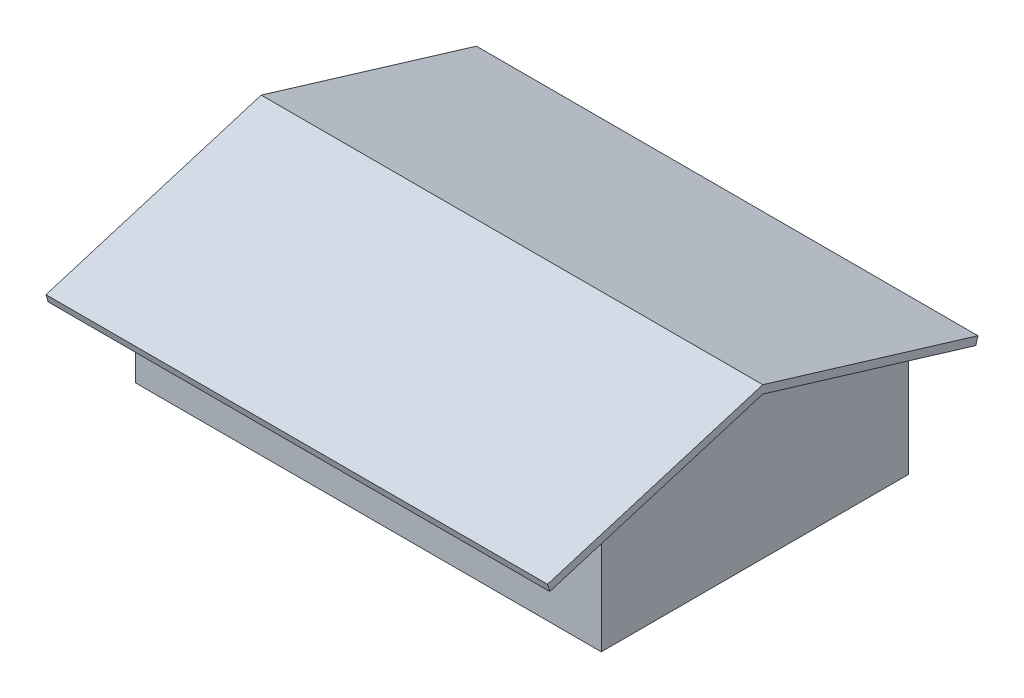
ISO-10303-21;
HEADER;
FILE_DESCRIPTION(('STEP AP214'),'2;1');
FILE_NAME('part.step','',(''),(''),'','','');
FILE_SCHEMA(('AUTOMOTIVE_DESIGN { 1 0 10303 214 1 1 1 1 }'));
ENDSEC;
DATA;
#1=APPLICATION_CONTEXT('core data for automotive mechanical design processes');
#2=APPLICATION_PROTOCOL_DEFINITION('international standard','automotive_design',2000,#1);
#3=PRODUCT_CONTEXT('',#1,'mechanical');
#4=PRODUCT('Part','Part','',(#3));
#5=PRODUCT_RELATED_PRODUCT_CATEGORY('part','',(#4));
#6=PRODUCT_DEFINITION_FORMATION('','',#4);
#7=PRODUCT_DEFINITION_CONTEXT('part definition',#1,'design');
#8=PRODUCT_DEFINITION('design','',#6,#7);
#9=PRODUCT_DEFINITION_SHAPE('','',#8);
#10=(LENGTH_UNIT() NAMED_UNIT(*) SI_UNIT(.MILLI.,.METRE.));
#11=(NAMED_UNIT(*) PLANE_ANGLE_UNIT() SI_UNIT($,.RADIAN.));
#12=(NAMED_UNIT(*) SI_UNIT($,.STERADIAN.) SOLID_ANGLE_UNIT());
#13=UNCERTAINTY_MEASURE_WITH_UNIT(LENGTH_MEASURE(1.E-05),#10,'distance_accuracy_value','');
#14=(GEOMETRIC_REPRESENTATION_CONTEXT(3) GLOBAL_UNCERTAINTY_ASSIGNED_CONTEXT((#13)) GLOBAL_UNIT_ASSIGNED_CONTEXT((#10,
#11,#12)) REPRESENTATION_CONTEXT('',''));
#15=CARTESIAN_POINT('',(0.,0.,0.));
#16=DIRECTION('',(0.,0.,1.));
#17=DIRECTION('',(1.,0.,0.));
#18=AXIS2_PLACEMENT_3D('',#15,#16,#17);
#19=CARTESIAN_POINT('',(7620.,0.,0.));
#20=DIRECTION('',(-1.,0.,0.));
#21=DIRECTION('',(0.,0.,1.));
#22=AXIS2_PLACEMENT_3D('',#19,#20,#21);
#23=PLANE('',#22);
#24=DIRECTION('',(0.,-0.290007395282871,-0.957024404433473));
#25=VECTOR('',#24,1.);
#26=CARTESIAN_POINT('',(7620.,4502.72101573984,-1364.46091386056));
#27=LINE('',#26,#25);
#28=CARTESIAN_POINT('',(7620.,4916.19401994001,3.10862446895044E-12));
#29=VERTEX_POINT('',#28);
#30=CARTESIAN_POINT('',(7620.,3392.19401994001,-5029.2));
#31=VERTEX_POINT('',#30);
#32=EDGE_CURVE('E148',#29,#31,#27,.T.);
#33=ORIENTED_EDGE('',*,*,#32,.F.);
#34=DIRECTION('',(0.,0.290007395282871,-0.957024404433473));
#35=VECTOR('',#34,1.);
#36=CARTESIAN_POINT('',(7620.,4502.72101573984,1364.46091386056));
#37=LINE('',#36,#35);
#38=CARTESIAN_POINT('',(7620.,3392.19401994001,5029.2));
#39=VERTEX_POINT('',#38);
#40=EDGE_CURVE('E45',#39,#29,#37,.T.);
#41=ORIENTED_EDGE('',*,*,#40,.F.);
#42=DIRECTION('',(0.,-1.,0.));
#43=VECTOR('',#42,1.);
#44=CARTESIAN_POINT('',(7620.,3392.19401994001,5029.2));
#45=LINE('',#44,#43);
#46=CARTESIAN_POINT('',(7620.,0.,5029.2));
#47=VERTEX_POINT('',#46);
#48=EDGE_CURVE('E190',#39,#47,#45,.T.);
#49=ORIENTED_EDGE('',*,*,#48,.T.);
#50=DIRECTION('',(0.,0.,-1.));
#51=VECTOR('',#50,1.);
#52=CARTESIAN_POINT('',(7620.,0.,5029.2));
#53=LINE('',#52,#51);
#54=CARTESIAN_POINT('',(7620.,0.,-5029.2));
#55=VERTEX_POINT('',#54);
#56=EDGE_CURVE('E54',#47,#55,#53,.T.);
#57=ORIENTED_EDGE('',*,*,#56,.T.);
#58=DIRECTION('',(0.,1.,0.));
#59=VECTOR('',#58,1.);
#60=CARTESIAN_POINT('',(7620.,0.,-5029.2));
#61=LINE('',#60,#59);
#62=EDGE_CURVE('E80',#55,#31,#61,.T.);
#63=ORIENTED_EDGE('',*,*,#62,.T.);
#64=EDGE_LOOP('',(#33,#41,#49,#57,#63));
#65=FACE_BOUND('',#64,.T.);
#66=ADVANCED_FACE('F35',(#65),#23,.F.);
#67=CARTESIAN_POINT('',(7620.,0.,-5029.2));
#68=DIRECTION('',(0.,0.,1.));
#69=DIRECTION('',(0.,-1.,0.));
#70=AXIS2_PLACEMENT_3D('',#67,#68,#69);
#71=PLANE('',#70);
#72=DIRECTION('',(0.,1.,0.));
#73=VECTOR('',#72,1.);
#74=CARTESIAN_POINT('',(-7620.,0.,-5029.2));
#75=LINE('',#74,#73);
#76=CARTESIAN_POINT('',(-7620.,0.,-5029.2));
#77=VERTEX_POINT('',#76);
#78=CARTESIAN_POINT('',(-7620.,3392.19401994001,-5029.2));
#79=VERTEX_POINT('',#78);
#80=EDGE_CURVE('E188',#77,#79,#75,.T.);
#81=ORIENTED_EDGE('',*,*,#80,.T.);
#82=DIRECTION('',(-1.,0.,0.));
#83=VECTOR('',#82,1.);
#84=CARTESIAN_POINT('',(7620.,3392.19401994001,-5029.2));
#85=LINE('',#84,#83);
#86=EDGE_CURVE('E39',#31,#79,#85,.T.);
#87=ORIENTED_EDGE('',*,*,#86,.F.);
#88=ORIENTED_EDGE('',*,*,#62,.F.);
#89=DIRECTION('',(-1.,0.,0.));
#90=VECTOR('',#89,1.);
#91=CARTESIAN_POINT('',(7620.,0.,-5029.2));
#92=LINE('',#91,#90);
#93=EDGE_CURVE('E193',#55,#77,#92,.T.);
#94=ORIENTED_EDGE('',*,*,#93,.T.);
#95=EDGE_LOOP('',(#81,#87,#88,#94));
#96=FACE_BOUND('',#95,.T.);
#97=ADVANCED_FACE('F37',(#96),#71,.F.);
#98=CARTESIAN_POINT('',(7620.,3392.19401994001,-5029.2));
#99=DIRECTION('',(0.,0.957024404433474,-0.290007395282871));
#100=DIRECTION('',(0.,0.290007395282871,0.957024404433474));
#101=AXIS2_PLACEMENT_3D('',#98,#99,#100);
#102=PLANE('',#101);
#103=ORIENTED_EDGE('',*,*,#86,.T.);
#104=DIRECTION('',(0.,0.290007395282871,0.957024404433474));
#105=VECTOR('',#104,1.);
#106=CARTESIAN_POINT('',(-7620.,4502.72101573984,-1364.46091386056));
#107=LINE('',#106,#105);
#108=CARTESIAN_POINT('',(-7620.,4916.19401994001,3.33066907387547E-12));
#109=VERTEX_POINT('',#108);
#110=EDGE_CURVE('E11',#79,#109,#107,.T.);
#111=ORIENTED_EDGE('',*,*,#110,.T.);
#112=DIRECTION('',(1.,0.,0.));
#113=VECTOR('',#112,1.);
#114=CARTESIAN_POINT('',(-8534.4,4916.19401994001,3.33066907387547E-12));
#115=LINE('',#114,#113);
#116=CARTESIAN_POINT('',(-8534.4,4916.19401994001,3.33066907387547E-12));
#117=VERTEX_POINT('',#116);
#118=EDGE_CURVE('E143',#117,#109,#115,.T.);
#119=ORIENTED_EDGE('',*,*,#118,.F.);
#120=DIRECTION('',(0.,0.290007395282871,0.957024404433473));
#121=VECTOR('',#120,1.);
#122=CARTESIAN_POINT('',(-8534.4,4502.72101573984,-1364.46091386056));
#123=LINE('',#122,#121);
#124=CARTESIAN_POINT('',(-8534.4,2804.9158012739,-6967.21812159815));
#125=VERTEX_POINT('',#124);
#126=EDGE_CURVE('E129',#125,#117,#123,.T.);
#127=ORIENTED_EDGE('',*,*,#126,.F.);
#128=DIRECTION('',(-1.,0.,0.));
#129=VECTOR('',#128,1.);
#130=CARTESIAN_POINT('',(7620.,2804.9158012739,-6967.21812159815));
#131=LINE('',#130,#129);
#132=CARTESIAN_POINT('',(7874.,2804.9158012739,-6967.21812159815));
#133=VERTEX_POINT('',#132);
#134=EDGE_CURVE('E209',#133,#125,#131,.T.);
#135=ORIENTED_EDGE('',*,*,#134,.F.);
#136=DIRECTION('',(0.,-0.290007395282871,-0.957024404433474));
#137=VECTOR('',#136,1.);
#138=CARTESIAN_POINT('',(7874.,4502.72101573984,-1364.46091386056));
#139=LINE('',#138,#137);
#140=CARTESIAN_POINT('',(7874.,4916.19401994001,3.10862446895044E-12));
#141=VERTEX_POINT('',#140);
#142=EDGE_CURVE('E175',#141,#133,#139,.T.);
#143=ORIENTED_EDGE('',*,*,#142,.F.);
#144=DIRECTION('',(-1.,0.,0.));
#145=VECTOR('',#144,1.);
#146=CARTESIAN_POINT('',(7874.,4916.19401994001,3.10862446895044E-12));
#147=LINE('',#146,#145);
#148=EDGE_CURVE('E181',#141,#29,#147,.T.);
#149=ORIENTED_EDGE('',*,*,#148,.T.);
#150=ORIENTED_EDGE('',*,*,#32,.T.);
#151=EDGE_LOOP('',(#103,#111,#119,#127,#135,#143,#149,#150));
#152=FACE_BOUND('',#151,.T.);
#153=ADVANCED_FACE('F145',(#152),#102,.F.);
#154=CARTESIAN_POINT('',(7620.,3048.,-7040.88));
#155=DIRECTION('',(0.,0.290007395282872,0.957024404433473));
#156=DIRECTION('',(0.,-0.957024404433473,0.290007395282872));
#157=AXIS2_PLACEMENT_3D('',#154,#155,#156);
#158=PLANE('',#157);
#159=ORIENTED_EDGE('',*,*,#134,.T.);
#160=DIRECTION('',(0.,-0.957024404433473,0.290007395282872));
#161=VECTOR('',#160,1.);
#162=CARTESIAN_POINT('',(-8534.4,-1697.80521446594,-5602.75720773759));
#163=LINE('',#162,#161);
#164=CARTESIAN_POINT('',(-8534.4,3048.,-7040.88));
#165=VERTEX_POINT('',#164);
#166=EDGE_CURVE('E138',#165,#125,#163,.T.);
#167=ORIENTED_EDGE('',*,*,#166,.F.);
#168=DIRECTION('',(-1.,0.,0.));
#169=VECTOR('',#168,1.);
#170=CARTESIAN_POINT('',(7620.,3048.,-7040.88));
#171=LINE('',#170,#169);
#172=CARTESIAN_POINT('',(7874.,3048.,-7040.88));
#173=VERTEX_POINT('',#172);
#174=EDGE_CURVE('E208',#173,#165,#171,.T.);
#175=ORIENTED_EDGE('',*,*,#174,.F.);
#176=DIRECTION('',(0.,0.957024404433473,-0.290007395282872));
#177=VECTOR('',#176,1.);
#178=CARTESIAN_POINT('',(7874.,-1697.80521446594,-5602.75720773759));
#179=LINE('',#178,#177);
#180=EDGE_CURVE('E178',#133,#173,#179,.T.);
#181=ORIENTED_EDGE('',*,*,#180,.F.);
#182=EDGE_LOOP('',(#159,#167,#175,#181));
#183=FACE_BOUND('',#182,.T.);
#184=ADVANCED_FACE('F224',(#183),#158,.F.);
#185=CARTESIAN_POINT('',(7620.,3657.6,-5029.2));
#186=DIRECTION('',(0.,-0.957024404433474,0.29000739528287));
#187=DIRECTION('',(0.,-0.29000739528287,-0.957024404433474));
#188=AXIS2_PLACEMENT_3D('',#185,#186,#187);
#189=PLANE('',#188);
#190=ORIENTED_EDGE('',*,*,#174,.T.);
#191=DIRECTION('',(0.,-0.290007395282871,-0.957024404433474));
#192=VECTOR('',#191,1.);
#193=CARTESIAN_POINT('',(-8534.4,4745.80521446594,-1438.12279226241));
#194=LINE('',#193,#192);
#195=CARTESIAN_POINT('',(-8534.4,5181.6,6.66133814775094E-13));
#196=VERTEX_POINT('',#195);
#197=EDGE_CURVE('E160',#196,#165,#194,.T.);
#198=ORIENTED_EDGE('',*,*,#197,.F.);
#199=DIRECTION('',(-1.,0.,0.));
#200=VECTOR('',#199,1.);
#201=CARTESIAN_POINT('',(7620.,5181.6,0.));
#202=LINE('',#201,#200);
#203=CARTESIAN_POINT('',(7874.,5181.6,-4.44089209850063E-13));
#204=VERTEX_POINT('',#203);
#205=EDGE_CURVE('E206',#204,#196,#202,.T.);
#206=ORIENTED_EDGE('',*,*,#205,.F.);
#207=DIRECTION('',(0.,0.290007395282871,0.957024404433474));
#208=VECTOR('',#207,1.);
#209=CARTESIAN_POINT('',(7874.,4745.80521446594,-1438.12279226241));
#210=LINE('',#209,#208);
#211=EDGE_CURVE('E164',#173,#204,#210,.T.);
#212=ORIENTED_EDGE('',*,*,#211,.F.);
#213=EDGE_LOOP('',(#190,#198,#206,#212));
#214=FACE_BOUND('',#213,.T.);
#215=ADVANCED_FACE('F227',(#214),#189,.F.);
#216=CARTESIAN_POINT('',(7620.,3657.6,5029.2));
#217=DIRECTION('',(0.,-0.957024404433473,-0.290007395282871));
#218=DIRECTION('',(0.,0.290007395282871,-0.957024404433473));
#219=AXIS2_PLACEMENT_3D('',#216,#217,#218);
#220=PLANE('',#219);
#221=ORIENTED_EDGE('',*,*,#205,.T.);
#222=DIRECTION('',(0.,0.290007395282871,-0.957024404433474));
#223=VECTOR('',#222,1.);
#224=CARTESIAN_POINT('',(-8534.4,4745.80521446594,1438.12279226241));
#225=LINE('',#224,#223);
#226=CARTESIAN_POINT('',(-8534.4,3048.,7040.88));
#227=VERTEX_POINT('',#226);
#228=EDGE_CURVE('E155',#227,#196,#225,.T.);
#229=ORIENTED_EDGE('',*,*,#228,.F.);
#230=DIRECTION('',(-1.,0.,0.));
#231=VECTOR('',#230,1.);
#232=CARTESIAN_POINT('',(7620.,3048.,7040.88));
#233=LINE('',#232,#231);
#234=CARTESIAN_POINT('',(7874.,3048.,7040.88));
#235=VERTEX_POINT('',#234);
#236=EDGE_CURVE('E204',#235,#227,#233,.T.);
#237=ORIENTED_EDGE('',*,*,#236,.F.);
#238=DIRECTION('',(0.,-0.290007395282871,0.957024404433474));
#239=VECTOR('',#238,1.);
#240=CARTESIAN_POINT('',(7874.,4745.80521446594,1438.12279226241));
#241=LINE('',#240,#239);
#242=EDGE_CURVE('E167',#204,#235,#241,.T.);
#243=ORIENTED_EDGE('',*,*,#242,.F.);
#244=EDGE_LOOP('',(#221,#229,#237,#243));
#245=FACE_BOUND('',#244,.T.);
#246=ADVANCED_FACE('F230',(#245),#220,.F.);
#247=CARTESIAN_POINT('',(7620.,3048.,7040.88));
#248=DIRECTION('',(0.,0.290007395282869,-0.957024404433474));
#249=DIRECTION('',(0.,0.957024404433474,0.290007395282869));
#250=AXIS2_PLACEMENT_3D('',#247,#248,#249);
#251=PLANE('',#250);
#252=ORIENTED_EDGE('',*,*,#236,.T.);
#253=DIRECTION('',(0.,0.957024404433474,0.290007395282869));
#254=VECTOR('',#253,1.);
#255=CARTESIAN_POINT('',(-8534.4,-1697.80521446593,5602.75720773761));
#256=LINE('',#255,#254);
#257=CARTESIAN_POINT('',(-8534.4,2804.9158012739,6967.21812159815));
#258=VERTEX_POINT('',#257);
#259=EDGE_CURVE('E153',#258,#227,#256,.T.);
#260=ORIENTED_EDGE('',*,*,#259,.F.);
#261=DIRECTION('',(-1.,0.,0.));
#262=VECTOR('',#261,1.);
#263=CARTESIAN_POINT('',(7620.,2804.9158012739,6967.21812159815));
#264=LINE('',#263,#262);
#265=CARTESIAN_POINT('',(7874.,2804.9158012739,6967.21812159815));
#266=VERTEX_POINT('',#265);
#267=EDGE_CURVE('E152',#266,#258,#264,.T.);
#268=ORIENTED_EDGE('',*,*,#267,.F.);
#269=DIRECTION('',(0.,-0.957024404433474,-0.290007395282869));
#270=VECTOR('',#269,1.);
#271=CARTESIAN_POINT('',(7874.,-1697.80521446593,5602.75720773761));
#272=LINE('',#271,#270);
#273=EDGE_CURVE('E170',#235,#266,#272,.T.);
#274=ORIENTED_EDGE('',*,*,#273,.F.);
#275=EDGE_LOOP('',(#252,#260,#268,#274));
#276=FACE_BOUND('',#275,.T.);
#277=ADVANCED_FACE('F234',(#276),#251,.F.);
#278=CARTESIAN_POINT('',(7620.,3392.19401994001,5029.2));
#279=DIRECTION('',(0.,0.957024404433473,0.290007395282871));
#280=DIRECTION('',(0.,-0.290007395282871,0.957024404433474));
#281=AXIS2_PLACEMENT_3D('',#278,#279,#280);
#282=PLANE('',#281);
#283=ORIENTED_EDGE('',*,*,#267,.T.);
#284=DIRECTION('',(0.,-0.290007395282871,0.957024404433473));
#285=VECTOR('',#284,1.);
#286=CARTESIAN_POINT('',(-8534.4,4502.72101573984,1364.46091386056));
#287=LINE('',#286,#285);
#288=EDGE_CURVE('E134',#117,#258,#287,.T.);
#289=ORIENTED_EDGE('',*,*,#288,.F.);
#290=ORIENTED_EDGE('',*,*,#118,.T.);
#291=DIRECTION('',(0.,-0.290007395282871,0.957024404433473));
#292=VECTOR('',#291,1.);
#293=CARTESIAN_POINT('',(-7620.,4502.72101573984,1364.46091386056));
#294=LINE('',#293,#292);
#295=CARTESIAN_POINT('',(-7620.,3392.19401994001,5029.2));
#296=VERTEX_POINT('',#295);
#297=EDGE_CURVE('E140',#109,#296,#294,.T.);
#298=ORIENTED_EDGE('',*,*,#297,.T.);
#299=DIRECTION('',(-1.,0.,0.));
#300=VECTOR('',#299,1.);
#301=CARTESIAN_POINT('',(7620.,3392.19401994001,5029.2));
#302=LINE('',#301,#300);
#303=EDGE_CURVE('E201',#39,#296,#302,.T.);
#304=ORIENTED_EDGE('',*,*,#303,.F.);
#305=ORIENTED_EDGE('',*,*,#40,.T.);
#306=ORIENTED_EDGE('',*,*,#148,.F.);
#307=DIRECTION('',(0.,0.290007395282871,-0.957024404433473));
#308=VECTOR('',#307,1.);
#309=CARTESIAN_POINT('',(7874.,4502.72101573984,1364.46091386056));
#310=LINE('',#309,#308);
#311=EDGE_CURVE('E173',#266,#141,#310,.T.);
#312=ORIENTED_EDGE('',*,*,#311,.F.);
#313=EDGE_LOOP('',(#283,#289,#290,#298,#304,#305,#306,#312));
#314=FACE_BOUND('',#313,.T.);
#315=ADVANCED_FACE('F150',(#314),#282,.F.);
#316=CARTESIAN_POINT('',(7620.,3392.19401994001,5029.2));
#317=DIRECTION('',(0.,0.,-1.));
#318=DIRECTION('',(0.,1.,0.));
#319=AXIS2_PLACEMENT_3D('',#316,#317,#318);
#320=PLANE('',#319);
#321=DIRECTION('',(0.,-1.,0.));
#322=VECTOR('',#321,1.);
#323=CARTESIAN_POINT('',(-7620.,3392.19401994001,5029.2));
#324=LINE('',#323,#322);
#325=CARTESIAN_POINT('',(-7620.,0.,5029.2));
#326=VERTEX_POINT('',#325);
#327=EDGE_CURVE('E69',#296,#326,#324,.T.);
#328=ORIENTED_EDGE('',*,*,#327,.T.);
#329=DIRECTION('',(-1.,0.,0.));
#330=VECTOR('',#329,1.);
#331=CARTESIAN_POINT('',(7620.,0.,5029.2));
#332=LINE('',#331,#330);
#333=EDGE_CURVE('E199',#47,#326,#332,.T.);
#334=ORIENTED_EDGE('',*,*,#333,.F.);
#335=ORIENTED_EDGE('',*,*,#48,.F.);
#336=ORIENTED_EDGE('',*,*,#303,.T.);
#337=EDGE_LOOP('',(#328,#334,#335,#336));
#338=FACE_BOUND('',#337,.T.);
#339=ADVANCED_FACE('F218',(#338),#320,.F.);
#340=CARTESIAN_POINT('',(7620.,0.,5029.2));
#341=DIRECTION('',(0.,1.,0.));
#342=DIRECTION('',(0.,0.,1.));
#343=AXIS2_PLACEMENT_3D('',#340,#341,#342);
#344=PLANE('',#343);
#345=DIRECTION('',(0.,0.,-1.));
#346=VECTOR('',#345,1.);
#347=CARTESIAN_POINT('',(-7620.,0.,5029.2));
#348=LINE('',#347,#346);
#349=EDGE_CURVE('E75',#326,#77,#348,.T.);
#350=ORIENTED_EDGE('',*,*,#349,.T.);
#351=ORIENTED_EDGE('',*,*,#93,.F.);
#352=ORIENTED_EDGE('',*,*,#56,.F.);
#353=ORIENTED_EDGE('',*,*,#333,.T.);
#354=EDGE_LOOP('',(#350,#351,#352,#353));
#355=FACE_BOUND('',#354,.T.);
#356=ADVANCED_FACE('F253',(#355),#344,.F.);
#357=CARTESIAN_POINT('',(-7620.,0.,0.));
#358=DIRECTION('',(-1.,0.,0.));
#359=DIRECTION('',(0.,0.,1.));
#360=AXIS2_PLACEMENT_3D('',#357,#358,#359);
#361=PLANE('',#360);
#362=ORIENTED_EDGE('',*,*,#110,.F.);
#363=ORIENTED_EDGE('',*,*,#80,.F.);
#364=ORIENTED_EDGE('',*,*,#349,.F.);
#365=ORIENTED_EDGE('',*,*,#327,.F.);
#366=ORIENTED_EDGE('',*,*,#297,.F.);
#367=EDGE_LOOP('',(#362,#363,#364,#365,#366));
#368=FACE_BOUND('',#367,.T.);
#369=ADVANCED_FACE('F215',(#368),#361,.T.);
#370=CARTESIAN_POINT('',(7874.,0.,0.));
#371=DIRECTION('',(-1.,0.,0.));
#372=DIRECTION('',(0.,0.,1.));
#373=AXIS2_PLACEMENT_3D('',#370,#371,#372);
#374=PLANE('',#373);
#375=ORIENTED_EDGE('',*,*,#211,.T.);
#376=ORIENTED_EDGE('',*,*,#242,.T.);
#377=ORIENTED_EDGE('',*,*,#273,.T.);
#378=ORIENTED_EDGE('',*,*,#311,.T.);
#379=ORIENTED_EDGE('',*,*,#142,.T.);
#380=ORIENTED_EDGE('',*,*,#180,.T.);
#381=EDGE_LOOP('',(#375,#376,#377,#378,#379,#380));
#382=FACE_BOUND('',#381,.T.);
#383=ADVANCED_FACE('F222',(#382),#374,.F.);
#384=CARTESIAN_POINT('',(-8534.4,0.,0.));
#385=DIRECTION('',(1.,0.,0.));
#386=DIRECTION('',(0.,0.,-1.));
#387=AXIS2_PLACEMENT_3D('',#384,#385,#386);
#388=PLANE('',#387);
#389=ORIENTED_EDGE('',*,*,#126,.T.);
#390=ORIENTED_EDGE('',*,*,#288,.T.);
#391=ORIENTED_EDGE('',*,*,#259,.T.);
#392=ORIENTED_EDGE('',*,*,#228,.T.);
#393=ORIENTED_EDGE('',*,*,#197,.T.);
#394=ORIENTED_EDGE('',*,*,#166,.T.);
#395=EDGE_LOOP('',(#389,#390,#391,#392,#393,#394));
#396=FACE_BOUND('',#395,.T.);
#397=ADVANCED_FACE('F131',(#396),#388,.F.);
#398=CLOSED_SHELL('',(#66,#97,#153,#184,#215,#246,#277,#315,#339,#356,#369,#383,#397));
#399=MANIFOLD_SOLID_BREP('B2',#398);
#400=ADVANCED_BREP_SHAPE_REPRESENTATION('',(#18,#399),#14);
#401=SHAPE_DEFINITION_REPRESENTATION(#9,#400);
ENDSEC;
END-ISO-10303-21;
